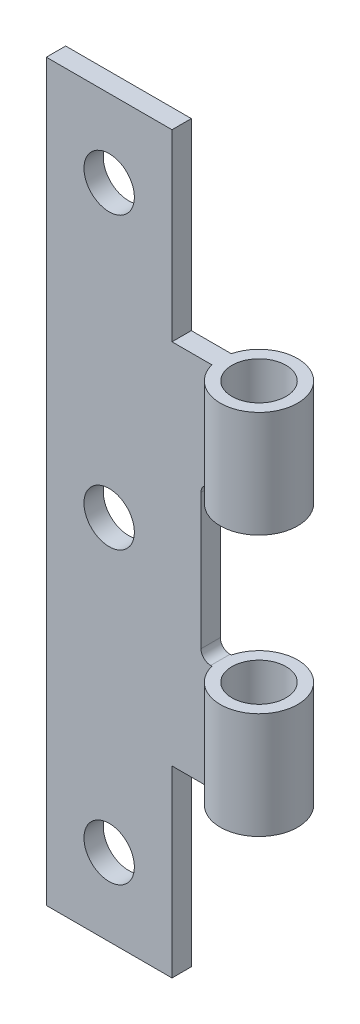
ISO-10303-21;
HEADER;
FILE_DESCRIPTION(('STEP AP214'),'2;1');
FILE_NAME('part.step','',(''),(''),'','','');
FILE_SCHEMA(('AUTOMOTIVE_DESIGN { 1 0 10303 214 1 1 1 1 }'));
ENDSEC;
DATA;
#1=APPLICATION_CONTEXT('core data for automotive mechanical design processes');
#2=APPLICATION_PROTOCOL_DEFINITION('international standard','automotive_design',2000,#1);
#3=PRODUCT_CONTEXT('',#1,'mechanical');
#4=PRODUCT('Part','Part','',(#3));
#5=PRODUCT_RELATED_PRODUCT_CATEGORY('part','',(#4));
#6=PRODUCT_DEFINITION_FORMATION('','',#4);
#7=PRODUCT_DEFINITION_CONTEXT('part definition',#1,'design');
#8=PRODUCT_DEFINITION('design','',#6,#7);
#9=PRODUCT_DEFINITION_SHAPE('','',#8);
#10=(LENGTH_UNIT() NAMED_UNIT(*) SI_UNIT(.MILLI.,.METRE.));
#11=(NAMED_UNIT(*) PLANE_ANGLE_UNIT() SI_UNIT($,.RADIAN.));
#12=(NAMED_UNIT(*) SI_UNIT($,.STERADIAN.) SOLID_ANGLE_UNIT());
#13=UNCERTAINTY_MEASURE_WITH_UNIT(LENGTH_MEASURE(1.E-05),#10,'distance_accuracy_value','');
#14=(GEOMETRIC_REPRESENTATION_CONTEXT(3) GLOBAL_UNCERTAINTY_ASSIGNED_CONTEXT((#13)) GLOBAL_UNIT_ASSIGNED_CONTEXT((#10,
#11,#12)) REPRESENTATION_CONTEXT('',''));
#15=CARTESIAN_POINT('',(0.,0.,0.));
#16=DIRECTION('',(0.,0.,1.));
#17=DIRECTION('',(1.,0.,0.));
#18=AXIS2_PLACEMENT_3D('',#15,#16,#17);
#19=CARTESIAN_POINT('',(0.,0.,0.));
#20=DIRECTION('',(0.,1.,0.));
#21=DIRECTION('',(0.,0.,1.));
#22=AXIS2_PLACEMENT_3D('',#19,#20,#21);
#23=PLANE('',#22);
#24=CARTESIAN_POINT('',(0.,0.,0.));
#25=DIRECTION('',(0.,1.,0.));
#26=DIRECTION('',(0.,0.,1.));
#27=AXIS2_PLACEMENT_3D('',#24,#25,#26);
#28=CIRCLE('',#27,1.4);
#29=CARTESIAN_POINT('',(0.,0.,1.4));
#30=VERTEX_POINT('',#29);
#31=EDGE_CURVE('E224',#30,#30,#28,.T.);
#32=ORIENTED_EDGE('',*,*,#31,.T.);
#33=EDGE_LOOP('',(#32));
#34=FACE_BOUND('',#33,.T.);
#35=DIRECTION('',(0.,0.,1.));
#36=VECTOR('',#35,1.);
#37=CARTESIAN_POINT('',(-4.,0.,0.500000000000002));
#38=LINE('',#37,#36);
#39=CARTESIAN_POINT('',(-4.,0.,-0.499999999999998));
#40=VERTEX_POINT('',#39);
#41=CARTESIAN_POINT('',(-4.,0.,0.500000000000002));
#42=VERTEX_POINT('',#41);
#43=EDGE_CURVE('E158',#40,#42,#38,.T.);
#44=ORIENTED_EDGE('',*,*,#43,.F.);
#45=DIRECTION('',(-1.,0.,0.));
#46=VECTOR('',#45,1.);
#47=CARTESIAN_POINT('',(-1.93649167310371,0.,-0.499999999999998));
#48=LINE('',#47,#46);
#49=CARTESIAN_POINT('',(-1.93649167310371,0.,-0.499999999999998));
#50=VERTEX_POINT('',#49);
#51=EDGE_CURVE('E242',#50,#40,#48,.T.);
#52=ORIENTED_EDGE('',*,*,#51,.F.);
#53=CARTESIAN_POINT('',(0.,0.,0.));
#54=DIRECTION('',(0.,1.,0.));
#55=DIRECTION('',(0.,0.,1.));
#56=AXIS2_PLACEMENT_3D('',#53,#54,#55);
#57=CIRCLE('',#56,2.);
#58=CARTESIAN_POINT('',(-1.93649167310371,0.,0.499999999999998));
#59=VERTEX_POINT('',#58);
#60=EDGE_CURVE('E228',#59,#50,#57,.T.);
#61=ORIENTED_EDGE('',*,*,#60,.F.);
#62=DIRECTION('',(1.,0.,0.));
#63=VECTOR('',#62,1.);
#64=CARTESIAN_POINT('',(-1.93649167310371,0.,0.499999999999998));
#65=LINE('',#64,#63);
#66=EDGE_CURVE('E235',#42,#59,#65,.T.);
#67=ORIENTED_EDGE('',*,*,#66,.F.);
#68=EDGE_LOOP('',(#44,#52,#61,#67));
#69=FACE_BOUND('',#68,.T.);
#70=ADVANCED_FACE('F34',(#34,#69),#23,.F.);
#71=CARTESIAN_POINT('',(0.,5.5,0.));
#72=DIRECTION('',(0.,1.,0.));
#73=DIRECTION('',(0.,0.,1.));
#74=AXIS2_PLACEMENT_3D('',#71,#72,#73);
#75=PLANE('',#74);
#76=DIRECTION('',(-1.,0.,0.));
#77=VECTOR('',#76,1.);
#78=CARTESIAN_POINT('',(-1.93649167310371,5.5,-0.499999999999998));
#79=LINE('',#78,#77);
#80=CARTESIAN_POINT('',(-1.93649167310371,5.5,-0.499999999999998));
#81=VERTEX_POINT('',#80);
#82=CARTESIAN_POINT('',(-2.,5.5,-0.499999999999998));
#83=VERTEX_POINT('',#82);
#84=EDGE_CURVE('E234',#81,#83,#79,.T.);
#85=ORIENTED_EDGE('',*,*,#84,.T.);
#86=DIRECTION('',(0.,0.,-1.));
#87=VECTOR('',#86,1.);
#88=CARTESIAN_POINT('',(-2.,5.5,0.));
#89=LINE('',#88,#87);
#90=CARTESIAN_POINT('',(-2.,5.5,0.499999999999998));
#91=VERTEX_POINT('',#90);
#92=EDGE_CURVE('E257',#83,#91,#89,.F.);
#93=ORIENTED_EDGE('',*,*,#92,.T.);
#94=DIRECTION('',(1.,0.,0.));
#95=VECTOR('',#94,1.);
#96=CARTESIAN_POINT('',(-1.93649167310371,5.5,0.499999999999998));
#97=LINE('',#96,#95);
#98=CARTESIAN_POINT('',(-1.93649167310371,5.5,0.499999999999998));
#99=VERTEX_POINT('',#98);
#100=EDGE_CURVE('E238',#91,#99,#97,.T.);
#101=ORIENTED_EDGE('',*,*,#100,.T.);
#102=CARTESIAN_POINT('',(0.,5.5,0.));
#103=DIRECTION('',(0.,1.,0.));
#104=DIRECTION('',(0.,0.,1.));
#105=AXIS2_PLACEMENT_3D('',#102,#103,#104);
#106=CIRCLE('',#105,2.);
#107=EDGE_CURVE('E231',#99,#81,#106,.T.);
#108=ORIENTED_EDGE('',*,*,#107,.T.);
#109=EDGE_LOOP('',(#85,#93,#101,#108));
#110=FACE_BOUND('',#109,.T.);
#111=CARTESIAN_POINT('',(0.,5.5,0.));
#112=DIRECTION('',(0.,1.,0.));
#113=DIRECTION('',(0.,0.,1.));
#114=AXIS2_PLACEMENT_3D('',#111,#112,#113);
#115=CIRCLE('',#114,1.4);
#116=CARTESIAN_POINT('',(0.,5.5,1.4));
#117=VERTEX_POINT('',#116);
#118=EDGE_CURVE('E225',#117,#117,#115,.T.);
#119=ORIENTED_EDGE('',*,*,#118,.F.);
#120=EDGE_LOOP('',(#119));
#121=FACE_BOUND('',#120,.T.);
#122=ADVANCED_FACE('F302',(#110,#121),#75,.T.);
#123=CARTESIAN_POINT('',(0.,5.5,0.));
#124=DIRECTION('',(0.,-1.,0.));
#125=DIRECTION('',(0.,0.,-1.));
#126=AXIS2_PLACEMENT_3D('',#123,#124,#125);
#127=CYLINDRICAL_SURFACE('',#126,2.);
#128=ORIENTED_EDGE('',*,*,#60,.T.);
#129=DIRECTION('',(0.,-1.,0.));
#130=VECTOR('',#129,1.);
#131=CARTESIAN_POINT('',(-1.93649167310371,5.5,-0.499999999999998));
#132=LINE('',#131,#130);
#133=EDGE_CURVE('E249',#81,#50,#132,.T.);
#134=ORIENTED_EDGE('',*,*,#133,.F.);
#135=ORIENTED_EDGE('',*,*,#107,.F.);
#136=DIRECTION('',(0.,-1.,0.));
#137=VECTOR('',#136,1.);
#138=CARTESIAN_POINT('',(-1.93649167310371,5.5,0.499999999999998));
#139=LINE('',#138,#137);
#140=EDGE_CURVE('E145',#99,#59,#139,.T.);
#141=ORIENTED_EDGE('',*,*,#140,.T.);
#142=EDGE_LOOP('',(#128,#134,#135,#141));
#143=FACE_BOUND('',#142,.T.);
#144=ADVANCED_FACE('F298',(#143),#127,.T.);
#145=CARTESIAN_POINT('',(-1.93649167310371,5.5,-0.499999999999998));
#146=DIRECTION('',(0.,0.,1.));
#147=DIRECTION('',(1.,0.,0.));
#148=AXIS2_PLACEMENT_3D('',#145,#146,#147);
#149=PLANE('',#148);
#150=CARTESIAN_POINT('',(-7.25,-5.5,-0.499999999999999));
#151=DIRECTION('',(0.,0.,1.));
#152=DIRECTION('',(1.,0.,0.));
#153=AXIS2_PLACEMENT_3D('',#150,#151,#152);
#154=CIRCLE('',#153,1.30386810746978);
#155=CARTESIAN_POINT('',(-5.94613189253022,-5.5,-0.499999999999999));
#156=VERTEX_POINT('',#155);
#157=EDGE_CURVE('E161',#156,#156,#154,.F.);
#158=ORIENTED_EDGE('',*,*,#157,.F.);
#159=EDGE_LOOP('',(#158));
#160=FACE_BOUND('',#159,.T.);
#161=CARTESIAN_POINT('',(-7.25,9.5,-0.499999999999999));
#162=DIRECTION('',(0.,0.,1.));
#163=DIRECTION('',(1.,0.,0.));
#164=AXIS2_PLACEMENT_3D('',#161,#162,#163);
#165=CIRCLE('',#164,1.30386810746978);
#166=CARTESIAN_POINT('',(-5.94613189253022,9.5,-0.499999999999999));
#167=VERTEX_POINT('',#166);
#168=EDGE_CURVE('E518',#167,#167,#165,.F.);
#169=ORIENTED_EDGE('',*,*,#168,.F.);
#170=EDGE_LOOP('',(#169));
#171=FACE_BOUND('',#170,.T.);
#172=CARTESIAN_POINT('',(-7.25,24.5,-0.499999999999999));
#173=DIRECTION('',(0.,0.,1.));
#174=DIRECTION('',(1.,0.,0.));
#175=AXIS2_PLACEMENT_3D('',#172,#173,#174);
#176=CIRCLE('',#175,1.30386810746978);
#177=CARTESIAN_POINT('',(-5.94613189253021,24.5,-0.499999999999999));
#178=VERTEX_POINT('',#177);
#179=EDGE_CURVE('E164',#178,#178,#176,.F.);
#180=ORIENTED_EDGE('',*,*,#179,.F.);
#181=EDGE_LOOP('',(#180));
#182=FACE_BOUND('',#181,.T.);
#183=ORIENTED_EDGE('',*,*,#51,.T.);
#184=DIRECTION('',(0.,1.,0.));
#185=VECTOR('',#184,1.);
#186=CARTESIAN_POINT('',(-4.,-9.5,-0.499999999999998));
#187=LINE('',#186,#185);
#188=CARTESIAN_POINT('',(-4.,-9.5,-0.499999999999998));
#189=VERTEX_POINT('',#188);
#190=EDGE_CURVE('E171',#189,#40,#187,.T.);
#191=ORIENTED_EDGE('',*,*,#190,.F.);
#192=DIRECTION('',(1.,0.,0.));
#193=VECTOR('',#192,1.);
#194=CARTESIAN_POINT('',(-10.5,-9.5,-0.5));
#195=LINE('',#194,#193);
#196=CARTESIAN_POINT('',(-10.5,-9.5,-0.5));
#197=VERTEX_POINT('',#196);
#198=EDGE_CURVE('E152',#197,#189,#195,.T.);
#199=ORIENTED_EDGE('',*,*,#198,.F.);
#200=DIRECTION('',(0.,-1.,0.));
#201=VECTOR('',#200,1.);
#202=CARTESIAN_POINT('',(-10.5,5.5,-0.5));
#203=LINE('',#202,#201);
#204=CARTESIAN_POINT('',(-10.5,28.5,-0.500000000000002));
#205=VERTEX_POINT('',#204);
#206=EDGE_CURVE('E144',#205,#197,#203,.T.);
#207=ORIENTED_EDGE('',*,*,#206,.F.);
#208=DIRECTION('',(-1.,0.,0.));
#209=VECTOR('',#208,1.);
#210=CARTESIAN_POINT('',(-10.5,28.5,-0.500000000000002));
#211=LINE('',#210,#209);
#212=CARTESIAN_POINT('',(-4.,28.5,-0.500000000000004));
#213=VERTEX_POINT('',#212);
#214=EDGE_CURVE('E175',#213,#205,#211,.T.);
#215=ORIENTED_EDGE('',*,*,#214,.F.);
#216=DIRECTION('',(0.,-1.,0.));
#217=VECTOR('',#216,1.);
#218=CARTESIAN_POINT('',(-4.,28.5,-0.500000000000004));
#219=LINE('',#218,#217);
#220=CARTESIAN_POINT('',(-4.,19.,-0.500000000000004));
#221=VERTEX_POINT('',#220);
#222=EDGE_CURVE('E183',#213,#221,#219,.T.);
#223=ORIENTED_EDGE('',*,*,#222,.T.);
#224=DIRECTION('',(-1.,0.,0.));
#225=VECTOR('',#224,1.);
#226=CARTESIAN_POINT('',(-1.93649167310371,19.,-0.499999999999998));
#227=LINE('',#226,#225);
#228=CARTESIAN_POINT('',(-1.93649167310371,19.,-0.499999999999998));
#229=VERTEX_POINT('',#228);
#230=EDGE_CURVE('E201',#229,#221,#227,.T.);
#231=ORIENTED_EDGE('',*,*,#230,.F.);
#232=DIRECTION('',(0.,-1.,0.));
#233=VECTOR('',#232,1.);
#234=CARTESIAN_POINT('',(-1.93649167310371,19.,-0.499999999999998));
#235=LINE('',#234,#233);
#236=CARTESIAN_POINT('',(-1.93649167310371,13.5,-0.499999999999998));
#237=VERTEX_POINT('',#236);
#238=EDGE_CURVE('E215',#229,#237,#235,.T.);
#239=ORIENTED_EDGE('',*,*,#238,.T.);
#240=DIRECTION('',(-1.,0.,0.));
#241=VECTOR('',#240,1.);
#242=CARTESIAN_POINT('',(-1.93649167310371,13.5,-0.499999999999998));
#243=LINE('',#242,#241);
#244=CARTESIAN_POINT('',(-2.,13.5,-0.499999999999998));
#245=VERTEX_POINT('',#244);
#246=EDGE_CURVE('E209',#237,#245,#243,.T.);
#247=ORIENTED_EDGE('',*,*,#246,.T.);
#248=CARTESIAN_POINT('',(-2.,13.,-0.499999999999998));
#249=DIRECTION('',(0.,0.,1.));
#250=DIRECTION('',(1.,0.,0.));
#251=AXIS2_PLACEMENT_3D('',#248,#249,#250);
#252=CIRCLE('',#251,0.5);
#253=CARTESIAN_POINT('',(-2.5,13.,-0.500000000000003));
#254=VERTEX_POINT('',#253);
#255=EDGE_CURVE('E42',#245,#254,#252,.T.);
#256=ORIENTED_EDGE('',*,*,#255,.T.);
#257=DIRECTION('',(0.,-1.,0.));
#258=VECTOR('',#257,1.);
#259=CARTESIAN_POINT('',(-2.5,19.002,-0.500000000000003));
#260=LINE('',#259,#258);
#261=CARTESIAN_POINT('',(-2.5,6.,-0.500000000000003));
#262=VERTEX_POINT('',#261);
#263=EDGE_CURVE('E221',#254,#262,#260,.T.);
#264=ORIENTED_EDGE('',*,*,#263,.T.);
#265=CARTESIAN_POINT('',(-2.,6.,-0.499999999999998));
#266=DIRECTION('',(0.,0.,1.));
#267=DIRECTION('',(1.,0.,0.));
#268=AXIS2_PLACEMENT_3D('',#265,#266,#267);
#269=CIRCLE('',#268,0.5);
#270=EDGE_CURVE('E261',#262,#83,#269,.T.);
#271=ORIENTED_EDGE('',*,*,#270,.T.);
#272=ORIENTED_EDGE('',*,*,#84,.F.);
#273=ORIENTED_EDGE('',*,*,#133,.T.);
#274=EDGE_LOOP('',(#183,#191,#199,#207,#215,#223,#231,#239,#247,#256,#264,#271,#272,#273));
#275=FACE_BOUND('',#274,.T.);
#276=ADVANCED_FACE('F266',(#160,#171,#182,#275),#149,.F.);
#277=CARTESIAN_POINT('',(-10.5,5.5,-0.5));
#278=DIRECTION('',(1.,0.,0.));
#279=DIRECTION('',(0.,0.,-1.));
#280=AXIS2_PLACEMENT_3D('',#277,#278,#279);
#281=PLANE('',#280);
#282=ORIENTED_EDGE('',*,*,#206,.T.);
#283=DIRECTION('',(0.,0.,-1.));
#284=VECTOR('',#283,1.);
#285=CARTESIAN_POINT('',(-10.5,-9.5,0.5));
#286=LINE('',#285,#284);
#287=CARTESIAN_POINT('',(-10.5,-9.5,0.5));
#288=VERTEX_POINT('',#287);
#289=EDGE_CURVE('E148',#288,#197,#286,.T.);
#290=ORIENTED_EDGE('',*,*,#289,.F.);
#291=DIRECTION('',(0.,-1.,0.));
#292=VECTOR('',#291,1.);
#293=CARTESIAN_POINT('',(-10.5,5.5,0.5));
#294=LINE('',#293,#292);
#295=CARTESIAN_POINT('',(-10.5,28.5,0.499999999999998));
#296=VERTEX_POINT('',#295);
#297=EDGE_CURVE('E133',#296,#288,#294,.T.);
#298=ORIENTED_EDGE('',*,*,#297,.F.);
#299=DIRECTION('',(0.,0.,1.));
#300=VECTOR('',#299,1.);
#301=CARTESIAN_POINT('',(-10.5,28.5,-0.500000000000002));
#302=LINE('',#301,#300);
#303=EDGE_CURVE('E178',#205,#296,#302,.T.);
#304=ORIENTED_EDGE('',*,*,#303,.F.);
#305=EDGE_LOOP('',(#282,#290,#298,#304));
#306=FACE_BOUND('',#305,.T.);
#307=ADVANCED_FACE('F149',(#306),#281,.F.);
#308=CARTESIAN_POINT('',(-1.93649167310371,5.5,0.499999999999998));
#309=DIRECTION('',(0.,0.,-1.));
#310=DIRECTION('',(-1.,0.,0.));
#311=AXIS2_PLACEMENT_3D('',#308,#309,#310);
#312=PLANE('',#311);
#313=CARTESIAN_POINT('',(-7.25,-5.5,0.499999999999997));
#314=DIRECTION('',(0.,0.,1.));
#315=DIRECTION('',(1.,0.,0.));
#316=AXIS2_PLACEMENT_3D('',#313,#314,#315);
#317=CIRCLE('',#316,1.30386810746978);
#318=CARTESIAN_POINT('',(-5.94613189253022,-5.5,0.499999999999997));
#319=VERTEX_POINT('',#318);
#320=EDGE_CURVE('E514',#319,#319,#317,.T.);
#321=ORIENTED_EDGE('',*,*,#320,.F.);
#322=EDGE_LOOP('',(#321));
#323=FACE_BOUND('',#322,.T.);
#324=CARTESIAN_POINT('',(-7.25,9.5,0.499999999999997));
#325=DIRECTION('',(0.,0.,1.));
#326=DIRECTION('',(1.,0.,0.));
#327=AXIS2_PLACEMENT_3D('',#324,#325,#326);
#328=CIRCLE('',#327,1.30386810746978);
#329=CARTESIAN_POINT('',(-5.94613189253022,9.5,0.499999999999997));
#330=VERTEX_POINT('',#329);
#331=EDGE_CURVE('E521',#330,#330,#328,.T.);
#332=ORIENTED_EDGE('',*,*,#331,.F.);
#333=EDGE_LOOP('',(#332));
#334=FACE_BOUND('',#333,.T.);
#335=CARTESIAN_POINT('',(-7.25,24.5,0.499999999999997));
#336=DIRECTION('',(0.,0.,1.));
#337=DIRECTION('',(1.,0.,0.));
#338=AXIS2_PLACEMENT_3D('',#335,#336,#337);
#339=CIRCLE('',#338,1.30386810746978);
#340=CARTESIAN_POINT('',(-5.94613189253021,24.5,0.499999999999997));
#341=VERTEX_POINT('',#340);
#342=EDGE_CURVE('E525',#341,#341,#339,.T.);
#343=ORIENTED_EDGE('',*,*,#342,.F.);
#344=EDGE_LOOP('',(#343));
#345=FACE_BOUND('',#344,.T.);
#346=ORIENTED_EDGE('',*,*,#297,.T.);
#347=DIRECTION('',(-1.,0.,0.));
#348=VECTOR('',#347,1.);
#349=CARTESIAN_POINT('',(-10.5,-9.5,0.5));
#350=LINE('',#349,#348);
#351=CARTESIAN_POINT('',(-4.,-9.5,0.500000000000002));
#352=VERTEX_POINT('',#351);
#353=EDGE_CURVE('E138',#352,#288,#350,.T.);
#354=ORIENTED_EDGE('',*,*,#353,.F.);
#355=DIRECTION('',(0.,1.,0.));
#356=VECTOR('',#355,1.);
#357=CARTESIAN_POINT('',(-4.,-9.5,0.500000000000002));
#358=LINE('',#357,#356);
#359=EDGE_CURVE('E168',#352,#42,#358,.T.);
#360=ORIENTED_EDGE('',*,*,#359,.T.);
#361=ORIENTED_EDGE('',*,*,#66,.T.);
#362=ORIENTED_EDGE('',*,*,#140,.F.);
#363=ORIENTED_EDGE('',*,*,#100,.F.);
#364=CARTESIAN_POINT('',(-2.,6.,0.499999999999998));
#365=DIRECTION('',(0.,0.,-1.));
#366=DIRECTION('',(-1.,0.,0.));
#367=AXIS2_PLACEMENT_3D('',#364,#365,#366);
#368=CIRCLE('',#367,0.5);
#369=CARTESIAN_POINT('',(-2.5,6.,0.499999999999998));
#370=VERTEX_POINT('',#369);
#371=EDGE_CURVE('E263',#91,#370,#368,.T.);
#372=ORIENTED_EDGE('',*,*,#371,.T.);
#373=DIRECTION('',(0.,-1.,0.));
#374=VECTOR('',#373,1.);
#375=CARTESIAN_POINT('',(-2.5,19.002,0.499999999999998));
#376=LINE('',#375,#374);
#377=CARTESIAN_POINT('',(-2.5,13.,0.499999999999998));
#378=VERTEX_POINT('',#377);
#379=EDGE_CURVE('E218',#378,#370,#376,.T.);
#380=ORIENTED_EDGE('',*,*,#379,.F.);
#381=CARTESIAN_POINT('',(-2.,13.,0.499999999999998));
#382=DIRECTION('',(0.,0.,-1.));
#383=DIRECTION('',(-1.,0.,0.));
#384=AXIS2_PLACEMENT_3D('',#381,#382,#383);
#385=CIRCLE('',#384,0.5);
#386=CARTESIAN_POINT('',(-2.,13.5,0.499999999999998));
#387=VERTEX_POINT('',#386);
#388=EDGE_CURVE('E11',#378,#387,#385,.T.);
#389=ORIENTED_EDGE('',*,*,#388,.T.);
#390=DIRECTION('',(1.,0.,0.));
#391=VECTOR('',#390,1.);
#392=CARTESIAN_POINT('',(-1.93649167310371,13.5,0.499999999999998));
#393=LINE('',#392,#391);
#394=CARTESIAN_POINT('',(-1.93649167310371,13.5,0.499999999999998));
#395=VERTEX_POINT('',#394);
#396=EDGE_CURVE('E202',#387,#395,#393,.T.);
#397=ORIENTED_EDGE('',*,*,#396,.T.);
#398=DIRECTION('',(0.,-1.,0.));
#399=VECTOR('',#398,1.);
#400=CARTESIAN_POINT('',(-1.93649167310371,19.,0.499999999999998));
#401=LINE('',#400,#399);
#402=CARTESIAN_POINT('',(-1.93649167310371,19.,0.499999999999998));
#403=VERTEX_POINT('',#402);
#404=EDGE_CURVE('E206',#403,#395,#401,.T.);
#405=ORIENTED_EDGE('',*,*,#404,.F.);
#406=DIRECTION('',(1.,0.,0.));
#407=VECTOR('',#406,1.);
#408=CARTESIAN_POINT('',(-1.93649167310371,19.,0.499999999999998));
#409=LINE('',#408,#407);
#410=CARTESIAN_POINT('',(-4.,19.,0.499999999999998));
#411=VERTEX_POINT('',#410);
#412=EDGE_CURVE('E204',#411,#403,#409,.T.);
#413=ORIENTED_EDGE('',*,*,#412,.F.);
#414=DIRECTION('',(0.,-1.,0.));
#415=VECTOR('',#414,1.);
#416=CARTESIAN_POINT('',(-4.,28.5,0.499999999999996));
#417=LINE('',#416,#415);
#418=CARTESIAN_POINT('',(-4.,28.5,0.499999999999996));
#419=VERTEX_POINT('',#418);
#420=EDGE_CURVE('E188',#419,#411,#417,.T.);
#421=ORIENTED_EDGE('',*,*,#420,.F.);
#422=DIRECTION('',(1.,0.,0.));
#423=VECTOR('',#422,1.);
#424=CARTESIAN_POINT('',(-10.5,28.5,0.499999999999998));
#425=LINE('',#424,#423);
#426=EDGE_CURVE('E140',#296,#419,#425,.T.);
#427=ORIENTED_EDGE('',*,*,#426,.F.);
#428=EDGE_LOOP('',(#346,#354,#360,#361,#362,#363,#372,#380,#389,#397,#405,#413,#421,#427));
#429=FACE_BOUND('',#428,.T.);
#430=ADVANCED_FACE('F135',(#323,#334,#345,#429),#312,.F.);
#431=CARTESIAN_POINT('',(0.,5.5,0.));
#432=DIRECTION('',(0.,-1.,0.));
#433=DIRECTION('',(0.,0.,-1.));
#434=AXIS2_PLACEMENT_3D('',#431,#432,#433);
#435=CYLINDRICAL_SURFACE('',#434,1.4);
#436=ORIENTED_EDGE('',*,*,#118,.T.);
#437=EDGE_LOOP('',(#436));
#438=FACE_BOUND('',#437,.T.);
#439=ORIENTED_EDGE('',*,*,#31,.F.);
#440=EDGE_LOOP('',(#439));
#441=FACE_BOUND('',#440,.T.);
#442=ADVANCED_FACE('F326',(#438,#441),#435,.F.);
#443=CARTESIAN_POINT('',(-2.5,19.002,-0.500000000000003));
#444=DIRECTION('',(-1.,0.,0.));
#445=DIRECTION('',(0.,0.,1.));
#446=AXIS2_PLACEMENT_3D('',#443,#444,#445);
#447=PLANE('',#446);
#448=ORIENTED_EDGE('',*,*,#379,.T.);
#449=DIRECTION('',(0.,0.,-1.));
#450=VECTOR('',#449,1.);
#451=CARTESIAN_POINT('',(-2.5,6.,-0.500000000000003));
#452=LINE('',#451,#450);
#453=EDGE_CURVE('E254',#370,#262,#452,.T.);
#454=ORIENTED_EDGE('',*,*,#453,.T.);
#455=ORIENTED_EDGE('',*,*,#263,.F.);
#456=DIRECTION('',(0.,0.,-1.));
#457=VECTOR('',#456,1.);
#458=CARTESIAN_POINT('',(-2.5,13.,0.499999999999998));
#459=LINE('',#458,#457);
#460=EDGE_CURVE('E252',#254,#378,#459,.F.);
#461=ORIENTED_EDGE('',*,*,#460,.T.);
#462=EDGE_LOOP('',(#448,#454,#455,#461));
#463=FACE_BOUND('',#462,.T.);
#464=ADVANCED_FACE('F268',(#463),#447,.F.);
#465=CARTESIAN_POINT('',(0.,13.5,0.));
#466=DIRECTION('',(0.,1.,0.));
#467=DIRECTION('',(0.,0.,1.));
#468=AXIS2_PLACEMENT_3D('',#465,#466,#467);
#469=PLANE('',#468);
#470=CARTESIAN_POINT('',(0.,13.5,0.));
#471=DIRECTION('',(0.,1.,0.));
#472=DIRECTION('',(0.,0.,1.));
#473=AXIS2_PLACEMENT_3D('',#470,#471,#472);
#474=CIRCLE('',#473,1.4);
#475=CARTESIAN_POINT('',(0.,13.5,1.4));
#476=VERTEX_POINT('',#475);
#477=EDGE_CURVE('E191',#476,#476,#474,.T.);
#478=ORIENTED_EDGE('',*,*,#477,.T.);
#479=EDGE_LOOP('',(#478));
#480=FACE_BOUND('',#479,.T.);
#481=ORIENTED_EDGE('',*,*,#396,.F.);
#482=DIRECTION('',(0.,0.,-1.));
#483=VECTOR('',#482,1.);
#484=CARTESIAN_POINT('',(-2.,13.5,-0.499999999999998));
#485=LINE('',#484,#483);
#486=EDGE_CURVE('E259',#387,#245,#485,.T.);
#487=ORIENTED_EDGE('',*,*,#486,.T.);
#488=ORIENTED_EDGE('',*,*,#246,.F.);
#489=CARTESIAN_POINT('',(0.,13.5,0.));
#490=DIRECTION('',(0.,1.,0.));
#491=DIRECTION('',(0.,0.,1.));
#492=AXIS2_PLACEMENT_3D('',#489,#490,#491);
#493=CIRCLE('',#492,2.);
#494=EDGE_CURVE('E195',#395,#237,#493,.T.);
#495=ORIENTED_EDGE('',*,*,#494,.F.);
#496=EDGE_LOOP('',(#481,#487,#488,#495));
#497=FACE_BOUND('',#496,.T.);
#498=ADVANCED_FACE('F271',(#480,#497),#469,.F.);
#499=CARTESIAN_POINT('',(0.,19.,0.));
#500=DIRECTION('',(0.,1.,0.));
#501=DIRECTION('',(0.,0.,1.));
#502=AXIS2_PLACEMENT_3D('',#499,#500,#501);
#503=PLANE('',#502);
#504=DIRECTION('',(0.,0.,-1.));
#505=VECTOR('',#504,1.);
#506=CARTESIAN_POINT('',(-4.,19.,-0.500000000000004));
#507=LINE('',#506,#505);
#508=EDGE_CURVE('E174',#411,#221,#507,.T.);
#509=ORIENTED_EDGE('',*,*,#508,.F.);
#510=ORIENTED_EDGE('',*,*,#412,.T.);
#511=CARTESIAN_POINT('',(0.,19.,0.));
#512=DIRECTION('',(0.,1.,0.));
#513=DIRECTION('',(0.,0.,1.));
#514=AXIS2_PLACEMENT_3D('',#511,#512,#513);
#515=CIRCLE('',#514,2.);
#516=EDGE_CURVE('E198',#403,#229,#515,.T.);
#517=ORIENTED_EDGE('',*,*,#516,.T.);
#518=ORIENTED_EDGE('',*,*,#230,.T.);
#519=EDGE_LOOP('',(#509,#510,#517,#518));
#520=FACE_BOUND('',#519,.T.);
#521=CARTESIAN_POINT('',(0.,19.,0.));
#522=DIRECTION('',(0.,1.,0.));
#523=DIRECTION('',(0.,0.,1.));
#524=AXIS2_PLACEMENT_3D('',#521,#522,#523);
#525=CIRCLE('',#524,1.4);
#526=CARTESIAN_POINT('',(0.,19.,1.4));
#527=VERTEX_POINT('',#526);
#528=EDGE_CURVE('E192',#527,#527,#525,.T.);
#529=ORIENTED_EDGE('',*,*,#528,.F.);
#530=EDGE_LOOP('',(#529));
#531=FACE_BOUND('',#530,.T.);
#532=ADVANCED_FACE('F280',(#520,#531),#503,.T.);
#533=CARTESIAN_POINT('',(0.,19.,0.));
#534=DIRECTION('',(0.,-1.,0.));
#535=DIRECTION('',(0.,0.,-1.));
#536=AXIS2_PLACEMENT_3D('',#533,#534,#535);
#537=CYLINDRICAL_SURFACE('',#536,2.);
#538=ORIENTED_EDGE('',*,*,#494,.T.);
#539=ORIENTED_EDGE('',*,*,#238,.F.);
#540=ORIENTED_EDGE('',*,*,#516,.F.);
#541=ORIENTED_EDGE('',*,*,#404,.T.);
#542=EDGE_LOOP('',(#538,#539,#540,#541));
#543=FACE_BOUND('',#542,.T.);
#544=ADVANCED_FACE('F277',(#543),#537,.T.);
#545=CARTESIAN_POINT('',(0.,19.,0.));
#546=DIRECTION('',(0.,-1.,0.));
#547=DIRECTION('',(0.,0.,-1.));
#548=AXIS2_PLACEMENT_3D('',#545,#546,#547);
#549=CYLINDRICAL_SURFACE('',#548,1.4);
#550=ORIENTED_EDGE('',*,*,#528,.T.);
#551=EDGE_LOOP('',(#550));
#552=FACE_BOUND('',#551,.T.);
#553=ORIENTED_EDGE('',*,*,#477,.F.);
#554=EDGE_LOOP('',(#553));
#555=FACE_BOUND('',#554,.T.);
#556=ADVANCED_FACE('F384',(#552,#555),#549,.F.);
#557=CARTESIAN_POINT('',(-4.,28.5,-0.500000000000004));
#558=DIRECTION('',(-1.,0.,0.));
#559=DIRECTION('',(0.,0.,1.));
#560=AXIS2_PLACEMENT_3D('',#557,#558,#559);
#561=PLANE('',#560);
#562=ORIENTED_EDGE('',*,*,#508,.T.);
#563=ORIENTED_EDGE('',*,*,#222,.F.);
#564=DIRECTION('',(0.,0.,-1.));
#565=VECTOR('',#564,1.);
#566=CARTESIAN_POINT('',(-4.,28.5,-0.500000000000004));
#567=LINE('',#566,#565);
#568=EDGE_CURVE('E181',#419,#213,#567,.T.);
#569=ORIENTED_EDGE('',*,*,#568,.F.);
#570=ORIENTED_EDGE('',*,*,#420,.T.);
#571=EDGE_LOOP('',(#562,#563,#569,#570));
#572=FACE_BOUND('',#571,.T.);
#573=ADVANCED_FACE('F284',(#572),#561,.F.);
#574=CARTESIAN_POINT('',(0.,28.5,0.));
#575=DIRECTION('',(0.,-1.,0.));
#576=DIRECTION('',(0.,0.,-1.));
#577=AXIS2_PLACEMENT_3D('',#574,#575,#576);
#578=PLANE('',#577);
#579=ORIENTED_EDGE('',*,*,#214,.T.);
#580=ORIENTED_EDGE('',*,*,#303,.T.);
#581=ORIENTED_EDGE('',*,*,#426,.T.);
#582=ORIENTED_EDGE('',*,*,#568,.T.);
#583=EDGE_LOOP('',(#579,#580,#581,#582));
#584=FACE_BOUND('',#583,.T.);
#585=ADVANCED_FACE('F288',(#584),#578,.F.);
#586=CARTESIAN_POINT('',(-4.,-9.5,0.500000000000002));
#587=DIRECTION('',(-1.,0.,0.));
#588=DIRECTION('',(0.,0.,1.));
#589=AXIS2_PLACEMENT_3D('',#586,#587,#588);
#590=PLANE('',#589);
#591=ORIENTED_EDGE('',*,*,#43,.T.);
#592=ORIENTED_EDGE('',*,*,#359,.F.);
#593=DIRECTION('',(0.,0.,1.));
#594=VECTOR('',#593,1.);
#595=CARTESIAN_POINT('',(-4.,-9.5,0.500000000000002));
#596=LINE('',#595,#594);
#597=EDGE_CURVE('E156',#189,#352,#596,.T.);
#598=ORIENTED_EDGE('',*,*,#597,.F.);
#599=ORIENTED_EDGE('',*,*,#190,.T.);
#600=EDGE_LOOP('',(#591,#592,#598,#599));
#601=FACE_BOUND('',#600,.T.);
#602=ADVANCED_FACE('F291',(#601),#590,.F.);
#603=CARTESIAN_POINT('',(0.,-9.5,0.));
#604=DIRECTION('',(0.,1.,0.));
#605=DIRECTION('',(0.,0.,1.));
#606=AXIS2_PLACEMENT_3D('',#603,#604,#605);
#607=PLANE('',#606);
#608=ORIENTED_EDGE('',*,*,#353,.T.);
#609=ORIENTED_EDGE('',*,*,#289,.T.);
#610=ORIENTED_EDGE('',*,*,#198,.T.);
#611=ORIENTED_EDGE('',*,*,#597,.T.);
#612=EDGE_LOOP('',(#608,#609,#610,#611));
#613=FACE_BOUND('',#612,.T.);
#614=ADVANCED_FACE('F154',(#613),#607,.F.);
#615=CARTESIAN_POINT('',(-2.,6.,-0.500000000000003));
#616=DIRECTION('',(0.,0.,-1.));
#617=DIRECTION('',(-1.,0.,0.));
#618=AXIS2_PLACEMENT_3D('',#615,#616,#617);
#619=CYLINDRICAL_SURFACE('',#618,0.5);
#620=ORIENTED_EDGE('',*,*,#371,.F.);
#621=ORIENTED_EDGE('',*,*,#92,.F.);
#622=ORIENTED_EDGE('',*,*,#270,.F.);
#623=ORIENTED_EDGE('',*,*,#453,.F.);
#624=EDGE_LOOP('',(#620,#621,#622,#623));
#625=FACE_BOUND('',#624,.T.);
#626=ADVANCED_FACE('F306',(#625),#619,.F.);
#627=CARTESIAN_POINT('',(-2.,13.,0.));
#628=DIRECTION('',(0.,0.,1.));
#629=DIRECTION('',(1.,0.,0.));
#630=AXIS2_PLACEMENT_3D('',#627,#628,#629);
#631=CYLINDRICAL_SURFACE('',#630,0.5);
#632=ORIENTED_EDGE('',*,*,#388,.F.);
#633=ORIENTED_EDGE('',*,*,#460,.F.);
#634=ORIENTED_EDGE('',*,*,#255,.F.);
#635=ORIENTED_EDGE('',*,*,#486,.F.);
#636=EDGE_LOOP('',(#632,#633,#634,#635));
#637=FACE_BOUND('',#636,.T.);
#638=ADVANCED_FACE('F36',(#637),#631,.F.);
#639=CARTESIAN_POINT('',(-7.25,24.5,-2.001));
#640=DIRECTION('',(0.,0.,1.));
#641=DIRECTION('',(1.,0.,0.));
#642=AXIS2_PLACEMENT_3D('',#639,#640,#641);
#643=CYLINDRICAL_SURFACE('',#642,1.30386810746978);
#644=ORIENTED_EDGE('',*,*,#342,.T.);
#645=EDGE_LOOP('',(#644));
#646=FACE_BOUND('',#645,.T.);
#647=ORIENTED_EDGE('',*,*,#179,.T.);
#648=EDGE_LOOP('',(#647));
#649=FACE_BOUND('',#648,.T.);
#650=ADVANCED_FACE('F312',(#646,#649),#643,.F.);
#651=CARTESIAN_POINT('',(-7.25,9.5,-2.001));
#652=DIRECTION('',(0.,0.,1.));
#653=DIRECTION('',(1.,0.,0.));
#654=AXIS2_PLACEMENT_3D('',#651,#652,#653);
#655=CYLINDRICAL_SURFACE('',#654,1.30386810746978);
#656=ORIENTED_EDGE('',*,*,#331,.T.);
#657=EDGE_LOOP('',(#656));
#658=FACE_BOUND('',#657,.T.);
#659=ORIENTED_EDGE('',*,*,#168,.T.);
#660=EDGE_LOOP('',(#659));
#661=FACE_BOUND('',#660,.T.);
#662=ADVANCED_FACE('F486',(#658,#661),#655,.F.);
#663=CARTESIAN_POINT('',(-7.25,-5.5,-2.001));
#664=DIRECTION('',(0.,0.,1.));
#665=DIRECTION('',(1.,0.,0.));
#666=AXIS2_PLACEMENT_3D('',#663,#664,#665);
#667=CYLINDRICAL_SURFACE('',#666,1.30386810746978);
#668=ORIENTED_EDGE('',*,*,#320,.T.);
#669=EDGE_LOOP('',(#668));
#670=FACE_BOUND('',#669,.T.);
#671=ORIENTED_EDGE('',*,*,#157,.T.);
#672=EDGE_LOOP('',(#671));
#673=FACE_BOUND('',#672,.T.);
#674=ADVANCED_FACE('F497',(#670,#673),#667,.F.);
#675=CLOSED_SHELL('',(#70,#122,#144,#276,#307,#430,#442,#464,#498,#532,#544,#556,#573,#585,#602,
#614,#626,#638,#650,#662,#674));
#676=MANIFOLD_SOLID_BREP('B2',#675);
#677=ADVANCED_BREP_SHAPE_REPRESENTATION('',(#18,#676),#14);
#678=SHAPE_DEFINITION_REPRESENTATION(#9,#677);
ENDSEC;
END-ISO-10303-21;
